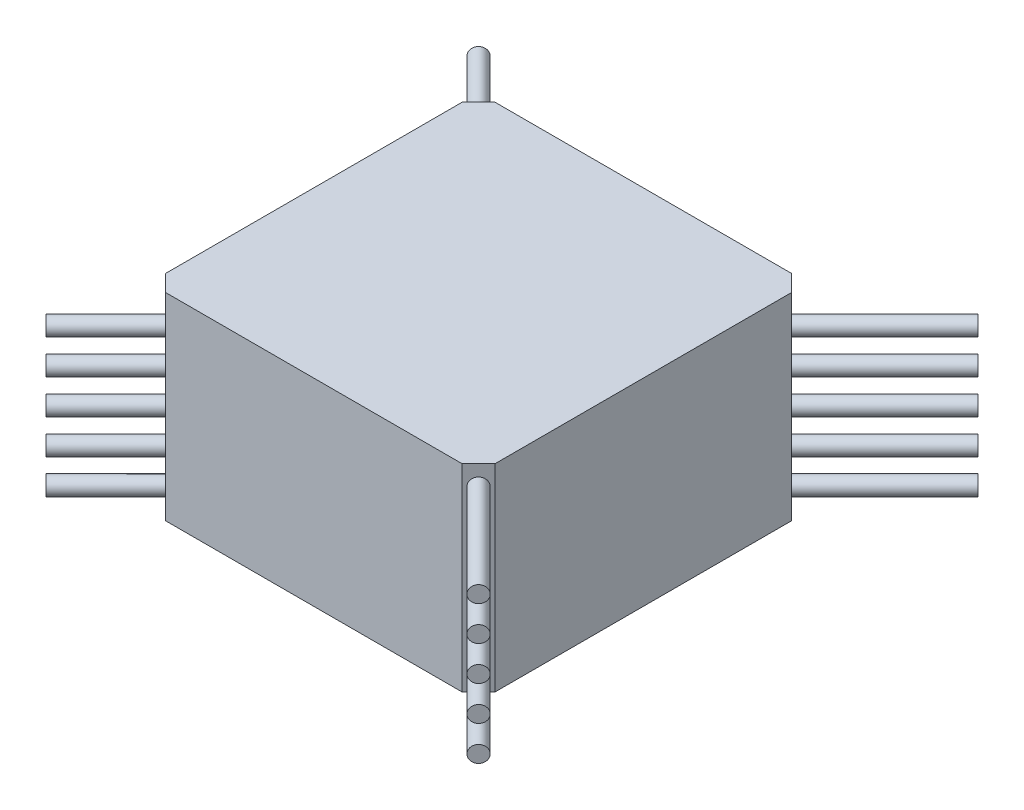
ISO-10303-21;
HEADER;
FILE_DESCRIPTION(('STEP AP214'),'2;1');
FILE_NAME('part.step','',(''),(''),'','','');
FILE_SCHEMA(('AUTOMOTIVE_DESIGN { 1 0 10303 214 1 1 1 1 }'));
ENDSEC;
DATA;
#1=APPLICATION_CONTEXT('core data for automotive mechanical design processes');
#2=APPLICATION_PROTOCOL_DEFINITION('international standard','automotive_design',2000,#1);
#3=PRODUCT_CONTEXT('',#1,'mechanical');
#4=PRODUCT('Part','Part','',(#3));
#5=PRODUCT_RELATED_PRODUCT_CATEGORY('part','',(#4));
#6=PRODUCT_DEFINITION_FORMATION('','',#4);
#7=PRODUCT_DEFINITION_CONTEXT('part definition',#1,'design');
#8=PRODUCT_DEFINITION('design','',#6,#7);
#9=PRODUCT_DEFINITION_SHAPE('','',#8);
#10=(LENGTH_UNIT() NAMED_UNIT(*) SI_UNIT(.MILLI.,.METRE.));
#11=(NAMED_UNIT(*) PLANE_ANGLE_UNIT() SI_UNIT($,.RADIAN.));
#12=(NAMED_UNIT(*) SI_UNIT($,.STERADIAN.) SOLID_ANGLE_UNIT());
#13=UNCERTAINTY_MEASURE_WITH_UNIT(LENGTH_MEASURE(1.E-05),#10,'distance_accuracy_value','');
#14=(GEOMETRIC_REPRESENTATION_CONTEXT(3) GLOBAL_UNCERTAINTY_ASSIGNED_CONTEXT((#13)) GLOBAL_UNIT_ASSIGNED_CONTEXT((#10,
#11,#12)) REPRESENTATION_CONTEXT('',''));
#15=CARTESIAN_POINT('',(0.,0.,0.));
#16=DIRECTION('',(0.,0.,1.));
#17=DIRECTION('',(1.,0.,0.));
#18=AXIS2_PLACEMENT_3D('',#15,#16,#17);
#19=CARTESIAN_POINT('',(-32.818542494924,3.4,32.8185424949236));
#20=DIRECTION('',(0.707106781186549,0.,-0.707106781186546));
#21=DIRECTION('',(-0.707106781186546,0.,-0.707106781186549));
#22=AXIS2_PLACEMENT_3D('',#19,#20,#21);
#23=CYLINDRICAL_SURFACE('',#22,1.25);
#24=CARTESIAN_POINT('',(-32.818542494924,3.4,32.8185424949236));
#25=DIRECTION('',(0.707106781186549,0.,-0.707106781186546));
#26=DIRECTION('',(-0.707106781186546,0.,-0.707106781186549));
#27=AXIS2_PLACEMENT_3D('',#24,#25,#26);
#28=CIRCLE('',#27,1.25);
#29=CARTESIAN_POINT('',(-33.7024259714072,3.4,31.9346590184404));
#30=VERTEX_POINT('',#29);
#31=EDGE_CURVE('E11',#30,#30,#28,.T.);
#32=ORIENTED_EDGE('',*,*,#31,.T.);
#33=EDGE_LOOP('',(#32));
#34=FACE_BOUND('',#33,.T.);
#35=CARTESIAN_POINT('',(37.8921356237309,3.4,-37.892135623731));
#36=DIRECTION('',(0.707106781186549,0.,-0.707106781186546));
#37=DIRECTION('',(-0.707106781186546,0.,-0.707106781186549));
#38=AXIS2_PLACEMENT_3D('',#35,#36,#37);
#39=CIRCLE('',#38,1.25);
#40=CARTESIAN_POINT('',(37.0082521472477,3.4,-38.7760191002142));
#41=VERTEX_POINT('',#40);
#42=EDGE_CURVE('E48',#41,#41,#39,.T.);
#43=ORIENTED_EDGE('',*,*,#42,.F.);
#44=EDGE_LOOP('',(#43));
#45=FACE_BOUND('',#44,.T.);
#46=ADVANCED_FACE('F42',(#34,#45),#23,.T.);
#47=CARTESIAN_POINT('',(-32.818542494924,3.4,32.8185424949236));
#48=DIRECTION('',(0.707106781186549,0.,-0.707106781186546));
#49=DIRECTION('',(-0.707106781186546,0.,-0.707106781186549));
#50=AXIS2_PLACEMENT_3D('',#47,#48,#49);
#51=PLANE('',#50);
#52=ORIENTED_EDGE('',*,*,#31,.F.);
#53=EDGE_LOOP('',(#52));
#54=FACE_BOUND('',#53,.T.);
#55=ADVANCED_FACE('F57',(#54),#51,.F.);
#56=CARTESIAN_POINT('',(37.8921356237309,3.4,-37.892135623731));
#57=DIRECTION('',(0.707106781186549,0.,-0.707106781186546));
#58=DIRECTION('',(-0.707106781186546,0.,-0.707106781186549));
#59=AXIS2_PLACEMENT_3D('',#56,#57,#58);
#60=PLANE('',#59);
#61=ORIENTED_EDGE('',*,*,#42,.T.);
#62=EDGE_LOOP('',(#61));
#63=FACE_BOUND('',#62,.T.);
#64=ADVANCED_FACE('F54',(#63),#60,.T.);
#65=CLOSED_SHELL('',(#46,#55,#64));
#66=MANIFOLD_SOLID_BREP('B2',#65);
#67=CARTESIAN_POINT('',(-32.818542494924,8.65,32.8185424949236));
#68=DIRECTION('',(0.707106781186549,0.,-0.707106781186546));
#69=DIRECTION('',(-0.707106781186546,0.,-0.707106781186549));
#70=AXIS2_PLACEMENT_3D('',#67,#68,#69);
#71=CYLINDRICAL_SURFACE('',#70,1.25);
#72=CARTESIAN_POINT('',(-32.818542494924,8.65,32.8185424949236));
#73=DIRECTION('',(0.707106781186549,0.,-0.707106781186546));
#74=DIRECTION('',(-0.707106781186546,0.,-0.707106781186549));
#75=AXIS2_PLACEMENT_3D('',#72,#73,#74);
#76=CIRCLE('',#75,1.25);
#77=CARTESIAN_POINT('',(-33.7024259714072,8.65,31.9346590184404));
#78=VERTEX_POINT('',#77);
#79=EDGE_CURVE('E41',#78,#78,#76,.T.);
#80=ORIENTED_EDGE('',*,*,#79,.T.);
#81=EDGE_LOOP('',(#80));
#82=FACE_BOUND('',#81,.T.);
#83=CARTESIAN_POINT('',(37.8921356237309,8.65,-37.892135623731));
#84=DIRECTION('',(0.707106781186549,0.,-0.707106781186546));
#85=DIRECTION('',(-0.707106781186546,0.,-0.707106781186549));
#86=AXIS2_PLACEMENT_3D('',#83,#84,#85);
#87=CIRCLE('',#86,1.25);
#88=CARTESIAN_POINT('',(37.0082521472477,8.65,-38.7760191002142));
#89=VERTEX_POINT('',#88);
#90=EDGE_CURVE('E97',#89,#89,#87,.T.);
#91=ORIENTED_EDGE('',*,*,#90,.F.);
#92=EDGE_LOOP('',(#91));
#93=FACE_BOUND('',#92,.T.);
#94=ADVANCED_FACE('F91',(#82,#93),#71,.T.);
#95=CARTESIAN_POINT('',(-32.818542494924,8.65,32.8185424949236));
#96=DIRECTION('',(0.707106781186549,0.,-0.707106781186546));
#97=DIRECTION('',(-0.707106781186546,0.,-0.707106781186549));
#98=AXIS2_PLACEMENT_3D('',#95,#96,#97);
#99=PLANE('',#98);
#100=ORIENTED_EDGE('',*,*,#79,.F.);
#101=EDGE_LOOP('',(#100));
#102=FACE_BOUND('',#101,.T.);
#103=ADVANCED_FACE('F106',(#102),#99,.F.);
#104=CARTESIAN_POINT('',(37.8921356237309,8.65,-37.892135623731));
#105=DIRECTION('',(0.707106781186549,0.,-0.707106781186546));
#106=DIRECTION('',(-0.707106781186546,0.,-0.707106781186549));
#107=AXIS2_PLACEMENT_3D('',#104,#105,#106);
#108=PLANE('',#107);
#109=ORIENTED_EDGE('',*,*,#90,.T.);
#110=EDGE_LOOP('',(#109));
#111=FACE_BOUND('',#110,.T.);
#112=ADVANCED_FACE('F103',(#111),#108,.T.);
#113=CLOSED_SHELL('',(#94,#103,#112));
#114=MANIFOLD_SOLID_BREP('B6',#113);
#115=CARTESIAN_POINT('',(-32.818542494924,13.9,32.8185424949237));
#116=DIRECTION('',(0.707106781186549,0.,-0.707106781186546));
#117=DIRECTION('',(-0.707106781186546,0.,-0.707106781186549));
#118=AXIS2_PLACEMENT_3D('',#115,#116,#117);
#119=CYLINDRICAL_SURFACE('',#118,1.25);
#120=CARTESIAN_POINT('',(-32.818542494924,13.9,32.8185424949237));
#121=DIRECTION('',(0.707106781186549,0.,-0.707106781186546));
#122=DIRECTION('',(-0.707106781186546,0.,-0.707106781186549));
#123=AXIS2_PLACEMENT_3D('',#120,#121,#122);
#124=CIRCLE('',#123,1.25);
#125=CARTESIAN_POINT('',(-33.7024259714071,13.9,31.9346590184405));
#126=VERTEX_POINT('',#125);
#127=EDGE_CURVE('E90',#126,#126,#124,.T.);
#128=ORIENTED_EDGE('',*,*,#127,.T.);
#129=EDGE_LOOP('',(#128));
#130=FACE_BOUND('',#129,.T.);
#131=CARTESIAN_POINT('',(37.892135623731,13.9,-37.892135623731));
#132=DIRECTION('',(0.707106781186549,0.,-0.707106781186546));
#133=DIRECTION('',(-0.707106781186546,0.,-0.707106781186549));
#134=AXIS2_PLACEMENT_3D('',#131,#132,#133);
#135=CIRCLE('',#134,1.25);
#136=CARTESIAN_POINT('',(37.0082521472478,13.9,-38.7760191002141));
#137=VERTEX_POINT('',#136);
#138=EDGE_CURVE('E146',#137,#137,#135,.T.);
#139=ORIENTED_EDGE('',*,*,#138,.F.);
#140=EDGE_LOOP('',(#139));
#141=FACE_BOUND('',#140,.T.);
#142=ADVANCED_FACE('F140',(#130,#141),#119,.T.);
#143=CARTESIAN_POINT('',(-32.818542494924,13.9,32.8185424949237));
#144=DIRECTION('',(0.707106781186549,0.,-0.707106781186546));
#145=DIRECTION('',(-0.707106781186546,0.,-0.707106781186549));
#146=AXIS2_PLACEMENT_3D('',#143,#144,#145);
#147=PLANE('',#146);
#148=ORIENTED_EDGE('',*,*,#127,.F.);
#149=EDGE_LOOP('',(#148));
#150=FACE_BOUND('',#149,.T.);
#151=ADVANCED_FACE('F155',(#150),#147,.F.);
#152=CARTESIAN_POINT('',(37.892135623731,13.9,-37.892135623731));
#153=DIRECTION('',(0.707106781186549,0.,-0.707106781186546));
#154=DIRECTION('',(-0.707106781186546,0.,-0.707106781186549));
#155=AXIS2_PLACEMENT_3D('',#152,#153,#154);
#156=PLANE('',#155);
#157=ORIENTED_EDGE('',*,*,#138,.T.);
#158=EDGE_LOOP('',(#157));
#159=FACE_BOUND('',#158,.T.);
#160=ADVANCED_FACE('F152',(#159),#156,.T.);
#161=CLOSED_SHELL('',(#142,#151,#160));
#162=MANIFOLD_SOLID_BREP('B36',#161);
#163=CARTESIAN_POINT('',(-32.8185424949239,19.15,32.8185424949237));
#164=DIRECTION('',(0.707106781186549,0.,-0.707106781186546));
#165=DIRECTION('',(-0.707106781186546,0.,-0.707106781186549));
#166=AXIS2_PLACEMENT_3D('',#163,#164,#165);
#167=CYLINDRICAL_SURFACE('',#166,1.25);
#168=CARTESIAN_POINT('',(-32.8185424949239,19.15,32.8185424949237));
#169=DIRECTION('',(0.707106781186549,0.,-0.707106781186546));
#170=DIRECTION('',(-0.707106781186546,0.,-0.707106781186549));
#171=AXIS2_PLACEMENT_3D('',#168,#169,#170);
#172=CIRCLE('',#171,1.25);
#173=CARTESIAN_POINT('',(-33.7024259714071,19.15,31.9346590184405));
#174=VERTEX_POINT('',#173);
#175=EDGE_CURVE('E139',#174,#174,#172,.T.);
#176=ORIENTED_EDGE('',*,*,#175,.T.);
#177=EDGE_LOOP('',(#176));
#178=FACE_BOUND('',#177,.T.);
#179=CARTESIAN_POINT('',(37.892135623731,19.15,-37.8921356237309));
#180=DIRECTION('',(0.707106781186549,0.,-0.707106781186546));
#181=DIRECTION('',(-0.707106781186546,0.,-0.707106781186549));
#182=AXIS2_PLACEMENT_3D('',#179,#180,#181);
#183=CIRCLE('',#182,1.25);
#184=CARTESIAN_POINT('',(37.0082521472478,19.15,-38.7760191002141));
#185=VERTEX_POINT('',#184);
#186=EDGE_CURVE('E195',#185,#185,#183,.T.);
#187=ORIENTED_EDGE('',*,*,#186,.F.);
#188=EDGE_LOOP('',(#187));
#189=FACE_BOUND('',#188,.T.);
#190=ADVANCED_FACE('F189',(#178,#189),#167,.T.);
#191=CARTESIAN_POINT('',(-32.8185424949239,19.15,32.8185424949237));
#192=DIRECTION('',(0.707106781186549,0.,-0.707106781186546));
#193=DIRECTION('',(-0.707106781186546,0.,-0.707106781186549));
#194=AXIS2_PLACEMENT_3D('',#191,#192,#193);
#195=PLANE('',#194);
#196=ORIENTED_EDGE('',*,*,#175,.F.);
#197=EDGE_LOOP('',(#196));
#198=FACE_BOUND('',#197,.T.);
#199=ADVANCED_FACE('F204',(#198),#195,.F.);
#200=CARTESIAN_POINT('',(37.892135623731,19.15,-37.8921356237309));
#201=DIRECTION('',(0.707106781186549,0.,-0.707106781186546));
#202=DIRECTION('',(-0.707106781186546,0.,-0.707106781186549));
#203=AXIS2_PLACEMENT_3D('',#200,#201,#202);
#204=PLANE('',#203);
#205=ORIENTED_EDGE('',*,*,#186,.T.);
#206=EDGE_LOOP('',(#205));
#207=FACE_BOUND('',#206,.T.);
#208=ADVANCED_FACE('F201',(#207),#204,.T.);
#209=CLOSED_SHELL('',(#190,#199,#208));
#210=MANIFOLD_SOLID_BREP('B85',#209);
#211=CARTESIAN_POINT('',(-32.8185424949239,24.4,32.8185424949237));
#212=DIRECTION('',(0.707106781186549,0.,-0.707106781186546));
#213=DIRECTION('',(-0.707106781186546,0.,-0.707106781186549));
#214=AXIS2_PLACEMENT_3D('',#211,#212,#213);
#215=CYLINDRICAL_SURFACE('',#214,1.25);
#216=CARTESIAN_POINT('',(-32.8185424949239,24.4,32.8185424949237));
#217=DIRECTION('',(0.707106781186549,0.,-0.707106781186546));
#218=DIRECTION('',(-0.707106781186546,0.,-0.707106781186549));
#219=AXIS2_PLACEMENT_3D('',#216,#217,#218);
#220=CIRCLE('',#219,1.25);
#221=CARTESIAN_POINT('',(-33.7024259714071,24.4,31.9346590184406));
#222=VERTEX_POINT('',#221);
#223=EDGE_CURVE('E188',#222,#222,#220,.T.);
#224=ORIENTED_EDGE('',*,*,#223,.T.);
#225=EDGE_LOOP('',(#224));
#226=FACE_BOUND('',#225,.T.);
#227=CARTESIAN_POINT('',(37.892135623731,24.4,-37.8921356237309));
#228=DIRECTION('',(0.707106781186549,0.,-0.707106781186546));
#229=DIRECTION('',(-0.707106781186546,0.,-0.707106781186549));
#230=AXIS2_PLACEMENT_3D('',#227,#228,#229);
#231=CIRCLE('',#230,1.25);
#232=CARTESIAN_POINT('',(37.0082521472478,24.4,-38.7760191002141));
#233=VERTEX_POINT('',#232);
#234=EDGE_CURVE('E244',#233,#233,#231,.T.);
#235=ORIENTED_EDGE('',*,*,#234,.F.);
#236=EDGE_LOOP('',(#235));
#237=FACE_BOUND('',#236,.T.);
#238=ADVANCED_FACE('F238',(#226,#237),#215,.T.);
#239=CARTESIAN_POINT('',(-32.8185424949239,24.4,32.8185424949237));
#240=DIRECTION('',(0.707106781186549,0.,-0.707106781186546));
#241=DIRECTION('',(-0.707106781186546,0.,-0.707106781186549));
#242=AXIS2_PLACEMENT_3D('',#239,#240,#241);
#243=PLANE('',#242);
#244=ORIENTED_EDGE('',*,*,#223,.F.);
#245=EDGE_LOOP('',(#244));
#246=FACE_BOUND('',#245,.T.);
#247=ADVANCED_FACE('F253',(#246),#243,.F.);
#248=CARTESIAN_POINT('',(37.892135623731,24.4,-37.8921356237309));
#249=DIRECTION('',(0.707106781186549,0.,-0.707106781186546));
#250=DIRECTION('',(-0.707106781186546,0.,-0.707106781186549));
#251=AXIS2_PLACEMENT_3D('',#248,#249,#250);
#252=PLANE('',#251);
#253=ORIENTED_EDGE('',*,*,#234,.T.);
#254=EDGE_LOOP('',(#253));
#255=FACE_BOUND('',#254,.T.);
#256=ADVANCED_FACE('F250',(#255),#252,.T.);
#257=CLOSED_SHELL('',(#238,#247,#256));
#258=MANIFOLD_SOLID_BREP('B134',#257);
#259=CARTESIAN_POINT('',(-32.8185424949238,6.,-32.8185424949238));
#260=DIRECTION('',(0.707106781186547,0.,0.707106781186548));
#261=DIRECTION('',(0.707106781186548,0.,-0.707106781186547));
#262=AXIS2_PLACEMENT_3D('',#259,#260,#261);
#263=CYLINDRICAL_SURFACE('',#262,1.25);
#264=CARTESIAN_POINT('',(-32.8185424949238,6.,-32.8185424949238));
#265=DIRECTION('',(0.707106781186547,0.,0.707106781186548));
#266=DIRECTION('',(0.707106781186548,0.,-0.707106781186547));
#267=AXIS2_PLACEMENT_3D('',#264,#265,#266);
#268=CIRCLE('',#267,1.25);
#269=CARTESIAN_POINT('',(-31.9346590184406,6.,-33.702425971407));
#270=VERTEX_POINT('',#269);
#271=EDGE_CURVE('E237',#270,#270,#268,.T.);
#272=ORIENTED_EDGE('',*,*,#271,.T.);
#273=EDGE_LOOP('',(#272));
#274=FACE_BOUND('',#273,.T.);
#275=CARTESIAN_POINT('',(37.8921356237309,6.,37.892135623731));
#276=DIRECTION('',(0.707106781186547,0.,0.707106781186548));
#277=DIRECTION('',(0.707106781186548,0.,-0.707106781186547));
#278=AXIS2_PLACEMENT_3D('',#275,#276,#277);
#279=CIRCLE('',#278,1.25);
#280=CARTESIAN_POINT('',(38.7760191002141,6.,37.0082521472478));
#281=VERTEX_POINT('',#280);
#282=EDGE_CURVE('E293',#281,#281,#279,.T.);
#283=ORIENTED_EDGE('',*,*,#282,.F.);
#284=EDGE_LOOP('',(#283));
#285=FACE_BOUND('',#284,.T.);
#286=ADVANCED_FACE('F287',(#274,#285),#263,.T.);
#287=CARTESIAN_POINT('',(-32.8185424949238,6.,-32.8185424949238));
#288=DIRECTION('',(0.707106781186547,0.,0.707106781186548));
#289=DIRECTION('',(0.707106781186548,0.,-0.707106781186547));
#290=AXIS2_PLACEMENT_3D('',#287,#288,#289);
#291=PLANE('',#290);
#292=ORIENTED_EDGE('',*,*,#271,.F.);
#293=EDGE_LOOP('',(#292));
#294=FACE_BOUND('',#293,.T.);
#295=ADVANCED_FACE('F302',(#294),#291,.F.);
#296=CARTESIAN_POINT('',(37.8921356237309,6.,37.892135623731));
#297=DIRECTION('',(0.707106781186547,0.,0.707106781186548));
#298=DIRECTION('',(0.707106781186548,0.,-0.707106781186547));
#299=AXIS2_PLACEMENT_3D('',#296,#297,#298);
#300=PLANE('',#299);
#301=ORIENTED_EDGE('',*,*,#282,.T.);
#302=EDGE_LOOP('',(#301));
#303=FACE_BOUND('',#302,.T.);
#304=ADVANCED_FACE('F299',(#303),#300,.T.);
#305=CLOSED_SHELL('',(#286,#295,#304));
#306=MANIFOLD_SOLID_BREP('B183',#305);
#307=CARTESIAN_POINT('',(-32.8185424949238,11.25,-32.8185424949238));
#308=DIRECTION('',(0.707106781186547,0.,0.707106781186548));
#309=DIRECTION('',(0.707106781186548,0.,-0.707106781186547));
#310=AXIS2_PLACEMENT_3D('',#307,#308,#309);
#311=CYLINDRICAL_SURFACE('',#310,1.25);
#312=CARTESIAN_POINT('',(-32.8185424949238,11.25,-32.8185424949238));
#313=DIRECTION('',(0.707106781186547,0.,0.707106781186548));
#314=DIRECTION('',(0.707106781186548,0.,-0.707106781186547));
#315=AXIS2_PLACEMENT_3D('',#312,#313,#314);
#316=CIRCLE('',#315,1.25);
#317=CARTESIAN_POINT('',(-31.9346590184406,11.25,-33.702425971407));
#318=VERTEX_POINT('',#317);
#319=EDGE_CURVE('E286',#318,#318,#316,.T.);
#320=ORIENTED_EDGE('',*,*,#319,.T.);
#321=EDGE_LOOP('',(#320));
#322=FACE_BOUND('',#321,.T.);
#323=CARTESIAN_POINT('',(37.8921356237309,11.25,37.892135623731));
#324=DIRECTION('',(0.707106781186547,0.,0.707106781186548));
#325=DIRECTION('',(0.707106781186548,0.,-0.707106781186547));
#326=AXIS2_PLACEMENT_3D('',#323,#324,#325);
#327=CIRCLE('',#326,1.25);
#328=CARTESIAN_POINT('',(38.7760191002141,11.25,37.0082521472478));
#329=VERTEX_POINT('',#328);
#330=EDGE_CURVE('E342',#329,#329,#327,.T.);
#331=ORIENTED_EDGE('',*,*,#330,.F.);
#332=EDGE_LOOP('',(#331));
#333=FACE_BOUND('',#332,.T.);
#334=ADVANCED_FACE('F336',(#322,#333),#311,.T.);
#335=CARTESIAN_POINT('',(-32.8185424949238,11.25,-32.8185424949238));
#336=DIRECTION('',(0.707106781186547,0.,0.707106781186548));
#337=DIRECTION('',(0.707106781186548,0.,-0.707106781186547));
#338=AXIS2_PLACEMENT_3D('',#335,#336,#337);
#339=PLANE('',#338);
#340=ORIENTED_EDGE('',*,*,#319,.F.);
#341=EDGE_LOOP('',(#340));
#342=FACE_BOUND('',#341,.T.);
#343=ADVANCED_FACE('F351',(#342),#339,.F.);
#344=CARTESIAN_POINT('',(37.8921356237309,11.25,37.892135623731));
#345=DIRECTION('',(0.707106781186547,0.,0.707106781186548));
#346=DIRECTION('',(0.707106781186548,0.,-0.707106781186547));
#347=AXIS2_PLACEMENT_3D('',#344,#345,#346);
#348=PLANE('',#347);
#349=ORIENTED_EDGE('',*,*,#330,.T.);
#350=EDGE_LOOP('',(#349));
#351=FACE_BOUND('',#350,.T.);
#352=ADVANCED_FACE('F348',(#351),#348,.T.);
#353=CLOSED_SHELL('',(#334,#343,#352));
#354=MANIFOLD_SOLID_BREP('B232',#353);
#355=CARTESIAN_POINT('',(-32.8185424949238,16.5,-32.8185424949238));
#356=DIRECTION('',(0.707106781186547,0.,0.707106781186548));
#357=DIRECTION('',(0.707106781186548,0.,-0.707106781186547));
#358=AXIS2_PLACEMENT_3D('',#355,#356,#357);
#359=CYLINDRICAL_SURFACE('',#358,1.25);
#360=CARTESIAN_POINT('',(-32.8185424949238,16.5,-32.8185424949238));
#361=DIRECTION('',(0.707106781186547,0.,0.707106781186548));
#362=DIRECTION('',(0.707106781186548,0.,-0.707106781186547));
#363=AXIS2_PLACEMENT_3D('',#360,#361,#362);
#364=CIRCLE('',#363,1.25);
#365=CARTESIAN_POINT('',(-31.9346590184406,16.5,-33.702425971407));
#366=VERTEX_POINT('',#365);
#367=EDGE_CURVE('E335',#366,#366,#364,.T.);
#368=ORIENTED_EDGE('',*,*,#367,.T.);
#369=EDGE_LOOP('',(#368));
#370=FACE_BOUND('',#369,.T.);
#371=CARTESIAN_POINT('',(37.8921356237309,16.5,37.892135623731));
#372=DIRECTION('',(0.707106781186547,0.,0.707106781186548));
#373=DIRECTION('',(0.707106781186548,0.,-0.707106781186547));
#374=AXIS2_PLACEMENT_3D('',#371,#372,#373);
#375=CIRCLE('',#374,1.25);
#376=CARTESIAN_POINT('',(38.7760191002141,16.5,37.0082521472478));
#377=VERTEX_POINT('',#376);
#378=EDGE_CURVE('E391',#377,#377,#375,.T.);
#379=ORIENTED_EDGE('',*,*,#378,.F.);
#380=EDGE_LOOP('',(#379));
#381=FACE_BOUND('',#380,.T.);
#382=ADVANCED_FACE('F385',(#370,#381),#359,.T.);
#383=CARTESIAN_POINT('',(-32.8185424949238,16.5,-32.8185424949238));
#384=DIRECTION('',(0.707106781186547,0.,0.707106781186548));
#385=DIRECTION('',(0.707106781186548,0.,-0.707106781186547));
#386=AXIS2_PLACEMENT_3D('',#383,#384,#385);
#387=PLANE('',#386);
#388=ORIENTED_EDGE('',*,*,#367,.F.);
#389=EDGE_LOOP('',(#388));
#390=FACE_BOUND('',#389,.T.);
#391=ADVANCED_FACE('F400',(#390),#387,.F.);
#392=CARTESIAN_POINT('',(37.8921356237309,16.5,37.892135623731));
#393=DIRECTION('',(0.707106781186547,0.,0.707106781186548));
#394=DIRECTION('',(0.707106781186548,0.,-0.707106781186547));
#395=AXIS2_PLACEMENT_3D('',#392,#393,#394);
#396=PLANE('',#395);
#397=ORIENTED_EDGE('',*,*,#378,.T.);
#398=EDGE_LOOP('',(#397));
#399=FACE_BOUND('',#398,.T.);
#400=ADVANCED_FACE('F397',(#399),#396,.T.);
#401=CLOSED_SHELL('',(#382,#391,#400));
#402=MANIFOLD_SOLID_BREP('B281',#401);
#403=CARTESIAN_POINT('',(-32.8185424949238,21.75,-32.8185424949238));
#404=DIRECTION('',(0.707106781186547,0.,0.707106781186548));
#405=DIRECTION('',(0.707106781186548,0.,-0.707106781186547));
#406=AXIS2_PLACEMENT_3D('',#403,#404,#405);
#407=CYLINDRICAL_SURFACE('',#406,1.25);
#408=CARTESIAN_POINT('',(-32.8185424949238,21.75,-32.8185424949238));
#409=DIRECTION('',(0.707106781186547,0.,0.707106781186548));
#410=DIRECTION('',(0.707106781186548,0.,-0.707106781186547));
#411=AXIS2_PLACEMENT_3D('',#408,#409,#410);
#412=CIRCLE('',#411,1.25);
#413=CARTESIAN_POINT('',(-31.9346590184406,21.75,-33.702425971407));
#414=VERTEX_POINT('',#413);
#415=EDGE_CURVE('E384',#414,#414,#412,.T.);
#416=ORIENTED_EDGE('',*,*,#415,.T.);
#417=EDGE_LOOP('',(#416));
#418=FACE_BOUND('',#417,.T.);
#419=CARTESIAN_POINT('',(37.8921356237309,21.75,37.892135623731));
#420=DIRECTION('',(0.707106781186547,0.,0.707106781186548));
#421=DIRECTION('',(0.707106781186548,0.,-0.707106781186547));
#422=AXIS2_PLACEMENT_3D('',#419,#420,#421);
#423=CIRCLE('',#422,1.25);
#424=CARTESIAN_POINT('',(38.7760191002141,21.75,37.0082521472478));
#425=VERTEX_POINT('',#424);
#426=EDGE_CURVE('E440',#425,#425,#423,.T.);
#427=ORIENTED_EDGE('',*,*,#426,.F.);
#428=EDGE_LOOP('',(#427));
#429=FACE_BOUND('',#428,.T.);
#430=ADVANCED_FACE('F434',(#418,#429),#407,.T.);
#431=CARTESIAN_POINT('',(-32.8185424949238,21.75,-32.8185424949238));
#432=DIRECTION('',(0.707106781186547,0.,0.707106781186548));
#433=DIRECTION('',(0.707106781186548,0.,-0.707106781186547));
#434=AXIS2_PLACEMENT_3D('',#431,#432,#433);
#435=PLANE('',#434);
#436=ORIENTED_EDGE('',*,*,#415,.F.);
#437=EDGE_LOOP('',(#436));
#438=FACE_BOUND('',#437,.T.);
#439=ADVANCED_FACE('F449',(#438),#435,.F.);
#440=CARTESIAN_POINT('',(37.8921356237309,21.75,37.892135623731));
#441=DIRECTION('',(0.707106781186547,0.,0.707106781186548));
#442=DIRECTION('',(0.707106781186548,0.,-0.707106781186547));
#443=AXIS2_PLACEMENT_3D('',#440,#441,#442);
#444=PLANE('',#443);
#445=ORIENTED_EDGE('',*,*,#426,.T.);
#446=EDGE_LOOP('',(#445));
#447=FACE_BOUND('',#446,.T.);
#448=ADVANCED_FACE('F446',(#447),#444,.T.);
#449=CLOSED_SHELL('',(#430,#439,#448));
#450=MANIFOLD_SOLID_BREP('B330',#449);
#451=CARTESIAN_POINT('',(-32.8185424949238,27.,-32.8185424949238));
#452=DIRECTION('',(0.707106781186547,0.,0.707106781186548));
#453=DIRECTION('',(0.707106781186548,0.,-0.707106781186547));
#454=AXIS2_PLACEMENT_3D('',#451,#452,#453);
#455=CYLINDRICAL_SURFACE('',#454,1.25);
#456=CARTESIAN_POINT('',(-32.8185424949238,27.,-32.8185424949238));
#457=DIRECTION('',(0.707106781186547,0.,0.707106781186548));
#458=DIRECTION('',(0.707106781186548,0.,-0.707106781186547));
#459=AXIS2_PLACEMENT_3D('',#456,#457,#458);
#460=CIRCLE('',#459,1.25);
#461=CARTESIAN_POINT('',(-31.9346590184406,27.,-33.702425971407));
#462=VERTEX_POINT('',#461);
#463=EDGE_CURVE('E433',#462,#462,#460,.T.);
#464=ORIENTED_EDGE('',*,*,#463,.T.);
#465=EDGE_LOOP('',(#464));
#466=FACE_BOUND('',#465,.T.);
#467=CARTESIAN_POINT('',(37.8921356237309,27.,37.892135623731));
#468=DIRECTION('',(0.707106781186547,0.,0.707106781186548));
#469=DIRECTION('',(0.707106781186548,0.,-0.707106781186547));
#470=AXIS2_PLACEMENT_3D('',#467,#468,#469);
#471=CIRCLE('',#470,1.25);
#472=CARTESIAN_POINT('',(38.7760191002141,27.,37.0082521472478));
#473=VERTEX_POINT('',#472);
#474=EDGE_CURVE('E490',#473,#473,#471,.T.);
#475=ORIENTED_EDGE('',*,*,#474,.F.);
#476=EDGE_LOOP('',(#475));
#477=FACE_BOUND('',#476,.T.);
#478=ADVANCED_FACE('F484',(#466,#477),#455,.T.);
#479=CARTESIAN_POINT('',(-32.8185424949238,27.,-32.8185424949238));
#480=DIRECTION('',(0.707106781186547,0.,0.707106781186548));
#481=DIRECTION('',(0.707106781186548,0.,-0.707106781186547));
#482=AXIS2_PLACEMENT_3D('',#479,#480,#481);
#483=PLANE('',#482);
#484=ORIENTED_EDGE('',*,*,#463,.F.);
#485=EDGE_LOOP('',(#484));
#486=FACE_BOUND('',#485,.T.);
#487=ADVANCED_FACE('F499',(#486),#483,.F.);
#488=CARTESIAN_POINT('',(37.8921356237309,27.,37.892135623731));
#489=DIRECTION('',(0.707106781186547,0.,0.707106781186548));
#490=DIRECTION('',(0.707106781186548,0.,-0.707106781186547));
#491=AXIS2_PLACEMENT_3D('',#488,#489,#490);
#492=PLANE('',#491);
#493=ORIENTED_EDGE('',*,*,#474,.T.);
#494=EDGE_LOOP('',(#493));
#495=FACE_BOUND('',#494,.T.);
#496=ADVANCED_FACE('F496',(#495),#492,.T.);
#497=CLOSED_SHELL('',(#478,#487,#496));
#498=MANIFOLD_SOLID_BREP('B379',#497);
#499=CARTESIAN_POINT('',(22.5,30.,-25.));
#500=DIRECTION('',(-0.707106781186549,0.,0.707106781186546));
#501=DIRECTION('',(0.707106781186546,0.,0.707106781186549));
#502=AXIS2_PLACEMENT_3D('',#499,#500,#501);
#503=PLANE('',#502);
#504=DIRECTION('',(-0.707106781186546,0.,-0.707106781186549));
#505=VECTOR('',#504,1.);
#506=CARTESIAN_POINT('',(22.5,0.,-25.));
#507=LINE('',#506,#505);
#508=CARTESIAN_POINT('',(25.,0.,-22.5));
#509=VERTEX_POINT('',#508);
#510=CARTESIAN_POINT('',(22.5,0.,-25.));
#511=VERTEX_POINT('',#510);
#512=EDGE_CURVE('E621',#509,#511,#507,.T.);
#513=ORIENTED_EDGE('',*,*,#512,.T.);
#514=DIRECTION('',(0.,-1.,0.));
#515=VECTOR('',#514,1.);
#516=CARTESIAN_POINT('',(22.5,30.,-25.));
#517=LINE('',#516,#515);
#518=CARTESIAN_POINT('',(22.5,30.,-25.));
#519=VERTEX_POINT('',#518);
#520=EDGE_CURVE('E482',#519,#511,#517,.T.);
#521=ORIENTED_EDGE('',*,*,#520,.F.);
#522=DIRECTION('',(-0.707106781186546,0.,-0.707106781186549));
#523=VECTOR('',#522,1.);
#524=CARTESIAN_POINT('',(22.5,30.,-25.));
#525=LINE('',#524,#523);
#526=CARTESIAN_POINT('',(25.,30.,-22.5));
#527=VERTEX_POINT('',#526);
#528=EDGE_CURVE('E635',#527,#519,#525,.T.);
#529=ORIENTED_EDGE('',*,*,#528,.F.);
#530=DIRECTION('',(0.,-1.,0.));
#531=VECTOR('',#530,1.);
#532=CARTESIAN_POINT('',(25.,30.,-22.5));
#533=LINE('',#532,#531);
#534=EDGE_CURVE('E617',#527,#509,#533,.T.);
#535=ORIENTED_EDGE('',*,*,#534,.T.);
#536=EDGE_LOOP('',(#513,#521,#529,#535));
#537=FACE_BOUND('',#536,.T.);
#538=ADVANCED_FACE('F525',(#537),#503,.F.);
#539=CARTESIAN_POINT('',(-22.5,30.,-25.));
#540=DIRECTION('',(0.,0.,1.));
#541=DIRECTION('',(1.,0.,0.));
#542=AXIS2_PLACEMENT_3D('',#539,#540,#541);
#543=PLANE('',#542);
#544=DIRECTION('',(-1.,0.,0.));
#545=VECTOR('',#544,1.);
#546=CARTESIAN_POINT('',(-22.5,0.,-25.));
#547=LINE('',#546,#545);
#548=CARTESIAN_POINT('',(-22.5,0.,-25.));
#549=VERTEX_POINT('',#548);
#550=EDGE_CURVE('E624',#511,#549,#547,.T.);
#551=ORIENTED_EDGE('',*,*,#550,.T.);
#552=DIRECTION('',(0.,-1.,0.));
#553=VECTOR('',#552,1.);
#554=CARTESIAN_POINT('',(-22.5,30.,-25.));
#555=LINE('',#554,#553);
#556=CARTESIAN_POINT('',(-22.5,30.,-25.));
#557=VERTEX_POINT('',#556);
#558=EDGE_CURVE('E533',#557,#549,#555,.T.);
#559=ORIENTED_EDGE('',*,*,#558,.F.);
#560=DIRECTION('',(-1.,0.,0.));
#561=VECTOR('',#560,1.);
#562=CARTESIAN_POINT('',(-22.5,30.,-25.));
#563=LINE('',#562,#561);
#564=EDGE_CURVE('E584',#519,#557,#563,.T.);
#565=ORIENTED_EDGE('',*,*,#564,.F.);
#566=ORIENTED_EDGE('',*,*,#520,.T.);
#567=EDGE_LOOP('',(#551,#559,#565,#566));
#568=FACE_BOUND('',#567,.T.);
#569=ADVANCED_FACE('F670',(#568),#543,.F.);
#570=CARTESIAN_POINT('',(-22.5,30.,-25.));
#571=DIRECTION('',(0.707106781186547,0.,0.707106781186548));
#572=DIRECTION('',(0.707106781186548,0.,-0.707106781186547));
#573=AXIS2_PLACEMENT_3D('',#570,#571,#572);
#574=PLANE('',#573);
#575=DIRECTION('',(-0.707106781186548,0.,0.707106781186547));
#576=VECTOR('',#575,1.);
#577=CARTESIAN_POINT('',(-22.5,0.,-25.));
#578=LINE('',#577,#576);
#579=CARTESIAN_POINT('',(-25.,0.,-22.5));
#580=VERTEX_POINT('',#579);
#581=EDGE_CURVE('E626',#549,#580,#578,.T.);
#582=ORIENTED_EDGE('',*,*,#581,.T.);
#583=DIRECTION('',(0.,-1.,0.));
#584=VECTOR('',#583,1.);
#585=CARTESIAN_POINT('',(-25.,30.,-22.5));
#586=LINE('',#585,#584);
#587=CARTESIAN_POINT('',(-25.,30.,-22.5));
#588=VERTEX_POINT('',#587);
#589=EDGE_CURVE('E642',#588,#580,#586,.T.);
#590=ORIENTED_EDGE('',*,*,#589,.F.);
#591=DIRECTION('',(-0.707106781186548,0.,0.707106781186547));
#592=VECTOR('',#591,1.);
#593=CARTESIAN_POINT('',(-22.5,30.,-25.));
#594=LINE('',#593,#592);
#595=EDGE_CURVE('E650',#557,#588,#594,.T.);
#596=ORIENTED_EDGE('',*,*,#595,.F.);
#597=ORIENTED_EDGE('',*,*,#558,.T.);
#598=EDGE_LOOP('',(#582,#590,#596,#597));
#599=FACE_BOUND('',#598,.T.);
#600=ADVANCED_FACE('F648',(#599),#574,.F.);
#601=CARTESIAN_POINT('',(-25.,30.,-22.5));
#602=DIRECTION('',(1.,0.,0.));
#603=DIRECTION('',(0.,0.,-1.));
#604=AXIS2_PLACEMENT_3D('',#601,#602,#603);
#605=PLANE('',#604);
#606=DIRECTION('',(0.,0.,1.));
#607=VECTOR('',#606,1.);
#608=CARTESIAN_POINT('',(-25.,0.,-22.5));
#609=LINE('',#608,#607);
#610=CARTESIAN_POINT('',(-25.,0.,22.5));
#611=VERTEX_POINT('',#610);
#612=EDGE_CURVE('E628',#580,#611,#609,.T.);
#613=ORIENTED_EDGE('',*,*,#612,.T.);
#614=DIRECTION('',(0.,-1.,0.));
#615=VECTOR('',#614,1.);
#616=CARTESIAN_POINT('',(-25.,30.,22.5));
#617=LINE('',#616,#615);
#618=CARTESIAN_POINT('',(-25.,30.,22.5));
#619=VERTEX_POINT('',#618);
#620=EDGE_CURVE('E639',#619,#611,#617,.T.);
#621=ORIENTED_EDGE('',*,*,#620,.F.);
#622=DIRECTION('',(0.,0.,1.));
#623=VECTOR('',#622,1.);
#624=CARTESIAN_POINT('',(-25.,30.,-22.5));
#625=LINE('',#624,#623);
#626=EDGE_CURVE('E662',#588,#619,#625,.T.);
#627=ORIENTED_EDGE('',*,*,#626,.F.);
#628=ORIENTED_EDGE('',*,*,#589,.T.);
#629=EDGE_LOOP('',(#613,#621,#627,#628));
#630=FACE_BOUND('',#629,.T.);
#631=ADVANCED_FACE('F658',(#630),#605,.F.);
#632=CARTESIAN_POINT('',(-25.,30.,22.5));
#633=DIRECTION('',(0.707106781186546,0.,-0.707106781186549));
#634=DIRECTION('',(-0.707106781186549,0.,-0.707106781186546));
#635=AXIS2_PLACEMENT_3D('',#632,#633,#634);
#636=PLANE('',#635);
#637=DIRECTION('',(0.707106781186549,0.,0.707106781186546));
#638=VECTOR('',#637,1.);
#639=CARTESIAN_POINT('',(-25.,0.,22.5));
#640=LINE('',#639,#638);
#641=CARTESIAN_POINT('',(-22.5,0.,25.));
#642=VERTEX_POINT('',#641);
#643=EDGE_CURVE('E630',#611,#642,#640,.T.);
#644=ORIENTED_EDGE('',*,*,#643,.T.);
#645=DIRECTION('',(0.,-1.,0.));
#646=VECTOR('',#645,1.);
#647=CARTESIAN_POINT('',(-22.5,30.,25.));
#648=LINE('',#647,#646);
#649=CARTESIAN_POINT('',(-22.5,30.,25.));
#650=VERTEX_POINT('',#649);
#651=EDGE_CURVE('E612',#650,#642,#648,.T.);
#652=ORIENTED_EDGE('',*,*,#651,.F.);
#653=DIRECTION('',(0.707106781186549,0.,0.707106781186546));
#654=VECTOR('',#653,1.);
#655=CARTESIAN_POINT('',(-25.,30.,22.5));
#656=LINE('',#655,#654);
#657=EDGE_CURVE('E603',#619,#650,#656,.T.);
#658=ORIENTED_EDGE('',*,*,#657,.F.);
#659=ORIENTED_EDGE('',*,*,#620,.T.);
#660=EDGE_LOOP('',(#644,#652,#658,#659));
#661=FACE_BOUND('',#660,.T.);
#662=ADVANCED_FACE('F661',(#661),#636,.F.);
#663=CARTESIAN_POINT('',(-22.5,30.,25.));
#664=DIRECTION('',(0.,0.,-1.));
#665=DIRECTION('',(-1.,0.,0.));
#666=AXIS2_PLACEMENT_3D('',#663,#664,#665);
#667=PLANE('',#666);
#668=DIRECTION('',(1.,0.,0.));
#669=VECTOR('',#668,1.);
#670=CARTESIAN_POINT('',(-22.5,0.,25.));
#671=LINE('',#670,#669);
#672=CARTESIAN_POINT('',(22.5,0.,25.));
#673=VERTEX_POINT('',#672);
#674=EDGE_CURVE('E611',#642,#673,#671,.T.);
#675=ORIENTED_EDGE('',*,*,#674,.T.);
#676=DIRECTION('',(0.,-1.,0.));
#677=VECTOR('',#676,1.);
#678=CARTESIAN_POINT('',(22.5,30.,25.));
#679=LINE('',#678,#677);
#680=CARTESIAN_POINT('',(22.5,30.,25.));
#681=VERTEX_POINT('',#680);
#682=EDGE_CURVE('E608',#681,#673,#679,.T.);
#683=ORIENTED_EDGE('',*,*,#682,.F.);
#684=DIRECTION('',(1.,0.,0.));
#685=VECTOR('',#684,1.);
#686=CARTESIAN_POINT('',(-22.5,30.,25.));
#687=LINE('',#686,#685);
#688=EDGE_CURVE('E597',#650,#681,#687,.T.);
#689=ORIENTED_EDGE('',*,*,#688,.F.);
#690=ORIENTED_EDGE('',*,*,#651,.T.);
#691=EDGE_LOOP('',(#675,#683,#689,#690));
#692=FACE_BOUND('',#691,.T.);
#693=ADVANCED_FACE('F609',(#692),#667,.F.);
#694=CARTESIAN_POINT('',(22.5,30.,25.));
#695=DIRECTION('',(-0.707106781186546,0.,-0.707106781186549));
#696=DIRECTION('',(-0.707106781186549,0.,0.707106781186546));
#697=AXIS2_PLACEMENT_3D('',#694,#695,#696);
#698=PLANE('',#697);
#699=DIRECTION('',(0.707106781186548,0.,-0.707106781186546));
#700=VECTOR('',#699,1.);
#701=CARTESIAN_POINT('',(22.5,0.,25.));
#702=LINE('',#701,#700);
#703=CARTESIAN_POINT('',(25.,0.,22.5));
#704=VERTEX_POINT('',#703);
#705=EDGE_CURVE('E570',#673,#704,#702,.T.);
#706=ORIENTED_EDGE('',*,*,#705,.T.);
#707=DIRECTION('',(0.,-1.,0.));
#708=VECTOR('',#707,1.);
#709=CARTESIAN_POINT('',(25.,30.,22.5));
#710=LINE('',#709,#708);
#711=CARTESIAN_POINT('',(25.,30.,22.5));
#712=VERTEX_POINT('',#711);
#713=EDGE_CURVE('E613',#712,#704,#710,.T.);
#714=ORIENTED_EDGE('',*,*,#713,.F.);
#715=DIRECTION('',(0.707106781186548,0.,-0.707106781186546));
#716=VECTOR('',#715,1.);
#717=CARTESIAN_POINT('',(22.5,30.,25.));
#718=LINE('',#717,#716);
#719=EDGE_CURVE('E601',#681,#712,#718,.T.);
#720=ORIENTED_EDGE('',*,*,#719,.F.);
#721=ORIENTED_EDGE('',*,*,#682,.T.);
#722=EDGE_LOOP('',(#706,#714,#720,#721));
#723=FACE_BOUND('',#722,.T.);
#724=ADVANCED_FACE('F615',(#723),#698,.F.);
#725=CARTESIAN_POINT('',(25.,30.,-22.5));
#726=DIRECTION('',(-1.,0.,0.));
#727=DIRECTION('',(0.,0.,1.));
#728=AXIS2_PLACEMENT_3D('',#725,#726,#727);
#729=PLANE('',#728);
#730=DIRECTION('',(0.,0.,-1.));
#731=VECTOR('',#730,1.);
#732=CARTESIAN_POINT('',(25.,0.,-22.5));
#733=LINE('',#732,#731);
#734=EDGE_CURVE('E576',#704,#509,#733,.T.);
#735=ORIENTED_EDGE('',*,*,#734,.T.);
#736=ORIENTED_EDGE('',*,*,#534,.F.);
#737=DIRECTION('',(0.,0.,-1.));
#738=VECTOR('',#737,1.);
#739=CARTESIAN_POINT('',(25.,30.,-22.5));
#740=LINE('',#739,#738);
#741=EDGE_CURVE('E541',#712,#527,#740,.T.);
#742=ORIENTED_EDGE('',*,*,#741,.F.);
#743=ORIENTED_EDGE('',*,*,#713,.T.);
#744=EDGE_LOOP('',(#735,#736,#742,#743));
#745=FACE_BOUND('',#744,.T.);
#746=ADVANCED_FACE('F686',(#745),#729,.F.);
#747=CARTESIAN_POINT('',(0.,30.,0.));
#748=DIRECTION('',(0.,1.,0.));
#749=DIRECTION('',(0.,0.,1.));
#750=AXIS2_PLACEMENT_3D('',#747,#748,#749);
#751=PLANE('',#750);
#752=ORIENTED_EDGE('',*,*,#528,.T.);
#753=ORIENTED_EDGE('',*,*,#564,.T.);
#754=ORIENTED_EDGE('',*,*,#595,.T.);
#755=ORIENTED_EDGE('',*,*,#626,.T.);
#756=ORIENTED_EDGE('',*,*,#657,.T.);
#757=ORIENTED_EDGE('',*,*,#688,.T.);
#758=ORIENTED_EDGE('',*,*,#719,.T.);
#759=ORIENTED_EDGE('',*,*,#741,.T.);
#760=EDGE_LOOP('',(#752,#753,#754,#755,#756,#757,#758,#759));
#761=FACE_BOUND('',#760,.T.);
#762=ADVANCED_FACE('F599',(#761),#751,.T.);
#763=CARTESIAN_POINT('',(0.,0.,0.));
#764=DIRECTION('',(0.,1.,0.));
#765=DIRECTION('',(0.,0.,1.));
#766=AXIS2_PLACEMENT_3D('',#763,#764,#765);
#767=PLANE('',#766);
#768=ORIENTED_EDGE('',*,*,#512,.F.);
#769=ORIENTED_EDGE('',*,*,#734,.F.);
#770=ORIENTED_EDGE('',*,*,#705,.F.);
#771=ORIENTED_EDGE('',*,*,#674,.F.);
#772=ORIENTED_EDGE('',*,*,#643,.F.);
#773=ORIENTED_EDGE('',*,*,#612,.F.);
#774=ORIENTED_EDGE('',*,*,#581,.F.);
#775=ORIENTED_EDGE('',*,*,#550,.F.);
#776=EDGE_LOOP('',(#768,#769,#770,#771,#772,#773,#774,#775));
#777=FACE_BOUND('',#776,.T.);
#778=ADVANCED_FACE('F654',(#777),#767,.F.);
#779=CLOSED_SHELL('',(#538,#569,#600,#631,#662,#693,#724,#746,#762,#778));
#780=MANIFOLD_SOLID_BREP('B428',#779);
#781=ADVANCED_BREP_SHAPE_REPRESENTATION('',(#18,#66,#114,#162,#210,#258,#306,#354,#402,#450,
#498,#780),#14);
#782=SHAPE_DEFINITION_REPRESENTATION(#9,#781);
ENDSEC;
END-ISO-10303-21;
